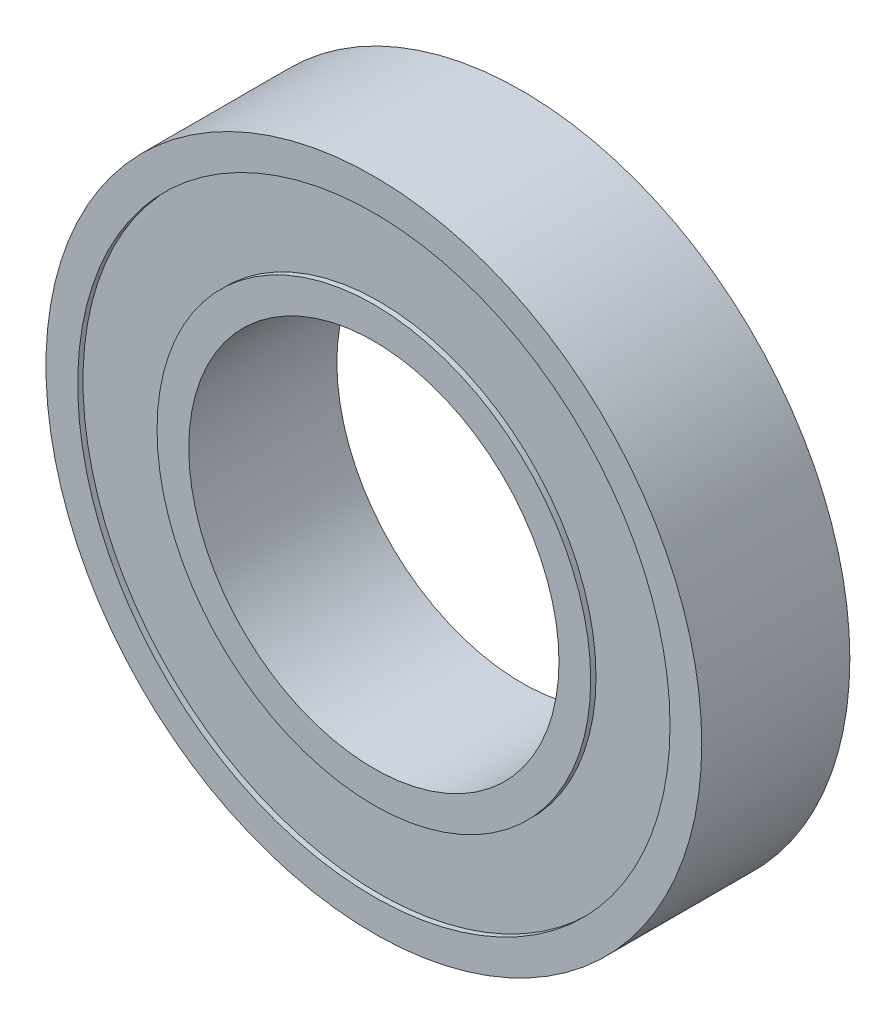
ISO-10303-21;
HEADER;
FILE_DESCRIPTION(('STEP AP214'),'2;1');
FILE_NAME('part.step','',(''),(''),'','','');
FILE_SCHEMA(('AUTOMOTIVE_DESIGN { 1 0 10303 214 1 1 1 1 }'));
ENDSEC;
DATA;
#1=APPLICATION_CONTEXT('core data for automotive mechanical design processes');
#2=APPLICATION_PROTOCOL_DEFINITION('international standard','automotive_design',2000,#1);
#3=PRODUCT_CONTEXT('',#1,'mechanical');
#4=PRODUCT('Part','Part','',(#3));
#5=PRODUCT_RELATED_PRODUCT_CATEGORY('part','',(#4));
#6=PRODUCT_DEFINITION_FORMATION('','',#4);
#7=PRODUCT_DEFINITION_CONTEXT('part definition',#1,'design');
#8=PRODUCT_DEFINITION('design','',#6,#7);
#9=PRODUCT_DEFINITION_SHAPE('','',#8);
#10=(LENGTH_UNIT() NAMED_UNIT(*) SI_UNIT(.MILLI.,.METRE.));
#11=(NAMED_UNIT(*) PLANE_ANGLE_UNIT() SI_UNIT($,.RADIAN.));
#12=(NAMED_UNIT(*) SI_UNIT($,.STERADIAN.) SOLID_ANGLE_UNIT());
#13=UNCERTAINTY_MEASURE_WITH_UNIT(LENGTH_MEASURE(1.E-05),#10,'distance_accuracy_value','');
#14=(GEOMETRIC_REPRESENTATION_CONTEXT(3) GLOBAL_UNCERTAINTY_ASSIGNED_CONTEXT((#13)) GLOBAL_UNIT_ASSIGNED_CONTEXT((#10,
#11,#12)) REPRESENTATION_CONTEXT('',''));
#15=CARTESIAN_POINT('',(0.,0.,0.));
#16=DIRECTION('',(0.,0.,1.));
#17=DIRECTION('',(1.,0.,0.));
#18=AXIS2_PLACEMENT_3D('',#15,#16,#17);
#19=CARTESIAN_POINT('',(0.,0.,14.));
#20=DIRECTION('',(0.,0.,-1.));
#21=DIRECTION('',(-1.,0.,0.));
#22=AXIS2_PLACEMENT_3D('',#19,#20,#21);
#23=CYLINDRICAL_SURFACE('',#22,28.);
#24=CARTESIAN_POINT('',(0.,0.,0.));
#25=DIRECTION('',(0.,0.,1.));
#26=DIRECTION('',(1.,0.,0.));
#27=AXIS2_PLACEMENT_3D('',#24,#25,#26);
#28=CIRCLE('',#27,28.);
#29=CARTESIAN_POINT('',(28.,0.,0.));
#30=VERTEX_POINT('',#29);
#31=EDGE_CURVE('E67',#30,#30,#28,.T.);
#32=ORIENTED_EDGE('',*,*,#31,.F.);
#33=EDGE_LOOP('',(#32));
#34=FACE_BOUND('',#33,.T.);
#35=CARTESIAN_POINT('',(0.,0.,0.5));
#36=DIRECTION('',(0.,0.,1.));
#37=DIRECTION('',(1.,0.,0.));
#38=AXIS2_PLACEMENT_3D('',#35,#36,#37);
#39=CIRCLE('',#38,28.);
#40=CARTESIAN_POINT('',(28.,0.,0.5));
#41=VERTEX_POINT('',#40);
#42=EDGE_CURVE('E100',#41,#41,#39,.T.);
#43=ORIENTED_EDGE('',*,*,#42,.T.);
#44=EDGE_LOOP('',(#43));
#45=FACE_BOUND('',#44,.T.);
#46=ADVANCED_FACE('F47',(#34,#45),#23,.F.);
#47=CARTESIAN_POINT('',(0.,0.,13.5));
#48=DIRECTION('',(0.,0.,1.));
#49=DIRECTION('',(1.,0.,0.));
#50=AXIS2_PLACEMENT_3D('',#47,#48,#49);
#51=CIRCLE('',#50,28.);
#52=CARTESIAN_POINT('',(28.,0.,13.5));
#53=VERTEX_POINT('',#52);
#54=EDGE_CURVE('E11',#53,#53,#51,.T.);
#55=ORIENTED_EDGE('',*,*,#54,.F.);
#56=EDGE_LOOP('',(#55));
#57=FACE_BOUND('',#56,.T.);
#58=CARTESIAN_POINT('',(0.,0.,14.));
#59=DIRECTION('',(0.,0.,1.));
#60=DIRECTION('',(1.,0.,0.));
#61=AXIS2_PLACEMENT_3D('',#58,#59,#60);
#62=CIRCLE('',#61,28.);
#63=CARTESIAN_POINT('',(28.,0.,14.));
#64=VERTEX_POINT('',#63);
#65=EDGE_CURVE('E58',#64,#64,#62,.T.);
#66=ORIENTED_EDGE('',*,*,#65,.T.);
#67=EDGE_LOOP('',(#66));
#68=FACE_BOUND('',#67,.T.);
#69=ADVANCED_FACE('F49',(#57,#68),#23,.F.);
#70=CARTESIAN_POINT('',(0.,0.,14.));
#71=DIRECTION('',(0.,0.,-1.));
#72=DIRECTION('',(-1.,0.,0.));
#73=AXIS2_PLACEMENT_3D('',#70,#71,#72);
#74=CYLINDRICAL_SURFACE('',#73,31.);
#75=CARTESIAN_POINT('',(0.,0.,14.));
#76=DIRECTION('',(0.,0.,1.));
#77=DIRECTION('',(1.,0.,0.));
#78=AXIS2_PLACEMENT_3D('',#75,#76,#77);
#79=CIRCLE('',#78,31.);
#80=CARTESIAN_POINT('',(31.,0.,14.));
#81=VERTEX_POINT('',#80);
#82=EDGE_CURVE('E54',#81,#81,#79,.T.);
#83=ORIENTED_EDGE('',*,*,#82,.F.);
#84=EDGE_LOOP('',(#83));
#85=FACE_BOUND('',#84,.T.);
#86=CARTESIAN_POINT('',(0.,0.,0.));
#87=DIRECTION('',(0.,0.,1.));
#88=DIRECTION('',(1.,0.,0.));
#89=AXIS2_PLACEMENT_3D('',#86,#87,#88);
#90=CIRCLE('',#89,31.);
#91=CARTESIAN_POINT('',(31.,0.,0.));
#92=VERTEX_POINT('',#91);
#93=EDGE_CURVE('E63',#92,#92,#90,.T.);
#94=ORIENTED_EDGE('',*,*,#93,.T.);
#95=EDGE_LOOP('',(#94));
#96=FACE_BOUND('',#95,.T.);
#97=ADVANCED_FACE('F73',(#85,#96),#74,.T.);
#98=CARTESIAN_POINT('',(0.,0.,14.));
#99=DIRECTION('',(0.,0.,1.));
#100=DIRECTION('',(1.,0.,0.));
#101=AXIS2_PLACEMENT_3D('',#98,#99,#100);
#102=PLANE('',#101);
#103=ORIENTED_EDGE('',*,*,#65,.F.);
#104=EDGE_LOOP('',(#103));
#105=FACE_BOUND('',#104,.T.);
#106=ORIENTED_EDGE('',*,*,#82,.T.);
#107=EDGE_LOOP('',(#106));
#108=FACE_BOUND('',#107,.T.);
#109=ADVANCED_FACE('F78',(#105,#108),#102,.T.);
#110=CARTESIAN_POINT('',(0.,0.,0.));
#111=DIRECTION('',(0.,0.,1.));
#112=DIRECTION('',(1.,0.,0.));
#113=AXIS2_PLACEMENT_3D('',#110,#111,#112);
#114=PLANE('',#113);
#115=ORIENTED_EDGE('',*,*,#31,.T.);
#116=EDGE_LOOP('',(#115));
#117=FACE_BOUND('',#116,.T.);
#118=ORIENTED_EDGE('',*,*,#93,.F.);
#119=EDGE_LOOP('',(#118));
#120=FACE_BOUND('',#119,.T.);
#121=ADVANCED_FACE('F75',(#117,#120),#114,.F.);
#122=CARTESIAN_POINT('',(0.,0.,13.5));
#123=DIRECTION('',(0.,0.,1.));
#124=DIRECTION('',(1.,0.,0.));
#125=AXIS2_PLACEMENT_3D('',#122,#123,#124);
#126=PLANE('',#125);
#127=CARTESIAN_POINT('',(0.,0.,13.5));
#128=DIRECTION('',(0.,0.,1.));
#129=DIRECTION('',(1.,0.,0.));
#130=AXIS2_PLACEMENT_3D('',#127,#128,#129);
#131=CIRCLE('',#130,20.5);
#132=CARTESIAN_POINT('',(20.5,0.,13.5));
#133=VERTEX_POINT('',#132);
#134=EDGE_CURVE('E69',#133,#133,#131,.T.);
#135=ORIENTED_EDGE('',*,*,#134,.F.);
#136=EDGE_LOOP('',(#135));
#137=FACE_BOUND('',#136,.T.);
#138=ORIENTED_EDGE('',*,*,#54,.T.);
#139=EDGE_LOOP('',(#138));
#140=FACE_BOUND('',#139,.T.);
#141=ADVANCED_FACE('F77',(#137,#140),#126,.T.);
#142=CARTESIAN_POINT('',(0.,0.,0.5));
#143=DIRECTION('',(0.,0.,1.));
#144=DIRECTION('',(1.,0.,0.));
#145=AXIS2_PLACEMENT_3D('',#142,#143,#144);
#146=PLANE('',#145);
#147=CARTESIAN_POINT('',(0.,0.,0.5));
#148=DIRECTION('',(0.,0.,1.));
#149=DIRECTION('',(1.,0.,0.));
#150=AXIS2_PLACEMENT_3D('',#147,#148,#149);
#151=CIRCLE('',#150,20.5);
#152=CARTESIAN_POINT('',(20.5,0.,0.5));
#153=VERTEX_POINT('',#152);
#154=EDGE_CURVE('E102',#153,#153,#151,.F.);
#155=ORIENTED_EDGE('',*,*,#154,.F.);
#156=EDGE_LOOP('',(#155));
#157=FACE_BOUND('',#156,.T.);
#158=ORIENTED_EDGE('',*,*,#42,.F.);
#159=EDGE_LOOP('',(#158));
#160=FACE_BOUND('',#159,.T.);
#161=ADVANCED_FACE('F86',(#157,#160),#146,.F.);
#162=CARTESIAN_POINT('',(0.,0.,14.));
#163=DIRECTION('',(0.,0.,-1.));
#164=DIRECTION('',(-1.,0.,0.));
#165=AXIS2_PLACEMENT_3D('',#162,#163,#164);
#166=CYLINDRICAL_SURFACE('',#165,20.5);
#167=CARTESIAN_POINT('',(0.,0.,0.));
#168=DIRECTION('',(0.,0.,1.));
#169=DIRECTION('',(1.,0.,0.));
#170=AXIS2_PLACEMENT_3D('',#167,#168,#169);
#171=CIRCLE('',#170,20.5);
#172=CARTESIAN_POINT('',(20.5,0.,0.));
#173=VERTEX_POINT('',#172);
#174=EDGE_CURVE('E109',#173,#173,#171,.T.);
#175=ORIENTED_EDGE('',*,*,#174,.T.);
#176=EDGE_LOOP('',(#175));
#177=FACE_BOUND('',#176,.T.);
#178=ORIENTED_EDGE('',*,*,#154,.T.);
#179=EDGE_LOOP('',(#178));
#180=FACE_BOUND('',#179,.T.);
#181=ADVANCED_FACE('F135',(#177,#180),#166,.T.);
#182=CARTESIAN_POINT('',(0.,0.,14.));
#183=DIRECTION('',(0.,0.,-1.));
#184=DIRECTION('',(-1.,0.,0.));
#185=AXIS2_PLACEMENT_3D('',#182,#183,#184);
#186=CYLINDRICAL_SURFACE('',#185,17.5);
#187=CARTESIAN_POINT('',(0.,0.,14.));
#188=DIRECTION('',(0.,0.,1.));
#189=DIRECTION('',(1.,0.,0.));
#190=AXIS2_PLACEMENT_3D('',#187,#188,#189);
#191=CIRCLE('',#190,17.5);
#192=CARTESIAN_POINT('',(17.5,0.,14.));
#193=VERTEX_POINT('',#192);
#194=EDGE_CURVE('E112',#193,#193,#191,.T.);
#195=ORIENTED_EDGE('',*,*,#194,.T.);
#196=EDGE_LOOP('',(#195));
#197=FACE_BOUND('',#196,.T.);
#198=CARTESIAN_POINT('',(0.,0.,0.));
#199=DIRECTION('',(0.,0.,1.));
#200=DIRECTION('',(1.,0.,0.));
#201=AXIS2_PLACEMENT_3D('',#198,#199,#200);
#202=CIRCLE('',#201,17.5);
#203=CARTESIAN_POINT('',(17.5,0.,0.));
#204=VERTEX_POINT('',#203);
#205=EDGE_CURVE('E113',#204,#204,#202,.T.);
#206=ORIENTED_EDGE('',*,*,#205,.F.);
#207=EDGE_LOOP('',(#206));
#208=FACE_BOUND('',#207,.T.);
#209=ADVANCED_FACE('F121',(#197,#208),#186,.F.);
#210=ORIENTED_EDGE('',*,*,#134,.T.);
#211=EDGE_LOOP('',(#210));
#212=FACE_BOUND('',#211,.T.);
#213=CARTESIAN_POINT('',(0.,0.,14.));
#214=DIRECTION('',(0.,0.,1.));
#215=DIRECTION('',(1.,0.,0.));
#216=AXIS2_PLACEMENT_3D('',#213,#214,#215);
#217=CIRCLE('',#216,20.5);
#218=CARTESIAN_POINT('',(20.5,0.,14.));
#219=VERTEX_POINT('',#218);
#220=EDGE_CURVE('E106',#219,#219,#217,.T.);
#221=ORIENTED_EDGE('',*,*,#220,.F.);
#222=EDGE_LOOP('',(#221));
#223=FACE_BOUND('',#222,.T.);
#224=ADVANCED_FACE('F128',(#212,#223),#166,.T.);
#225=CARTESIAN_POINT('',(0.,0.,14.));
#226=DIRECTION('',(0.,0.,1.));
#227=DIRECTION('',(1.,0.,0.));
#228=AXIS2_PLACEMENT_3D('',#225,#226,#227);
#229=PLANE('',#228);
#230=ORIENTED_EDGE('',*,*,#194,.F.);
#231=EDGE_LOOP('',(#230));
#232=FACE_BOUND('',#231,.T.);
#233=ORIENTED_EDGE('',*,*,#220,.T.);
#234=EDGE_LOOP('',(#233));
#235=FACE_BOUND('',#234,.T.);
#236=ADVANCED_FACE('F124',(#232,#235),#229,.T.);
#237=CARTESIAN_POINT('',(0.,0.,0.));
#238=DIRECTION('',(0.,0.,1.));
#239=DIRECTION('',(1.,0.,0.));
#240=AXIS2_PLACEMENT_3D('',#237,#238,#239);
#241=PLANE('',#240);
#242=ORIENTED_EDGE('',*,*,#205,.T.);
#243=EDGE_LOOP('',(#242));
#244=FACE_BOUND('',#243,.T.);
#245=ORIENTED_EDGE('',*,*,#174,.F.);
#246=EDGE_LOOP('',(#245));
#247=FACE_BOUND('',#246,.T.);
#248=ADVANCED_FACE('F127',(#244,#247),#241,.F.);
#249=CLOSED_SHELL('',(#46,#69,#97,#109,#121,#141,#161,#181,#209,#224,#236,#248));
#250=MANIFOLD_SOLID_BREP('B2',#249);
#251=ADVANCED_BREP_SHAPE_REPRESENTATION('',(#18,#250),#14);
#252=SHAPE_DEFINITION_REPRESENTATION(#9,#251);
ENDSEC;
END-ISO-10303-21;
